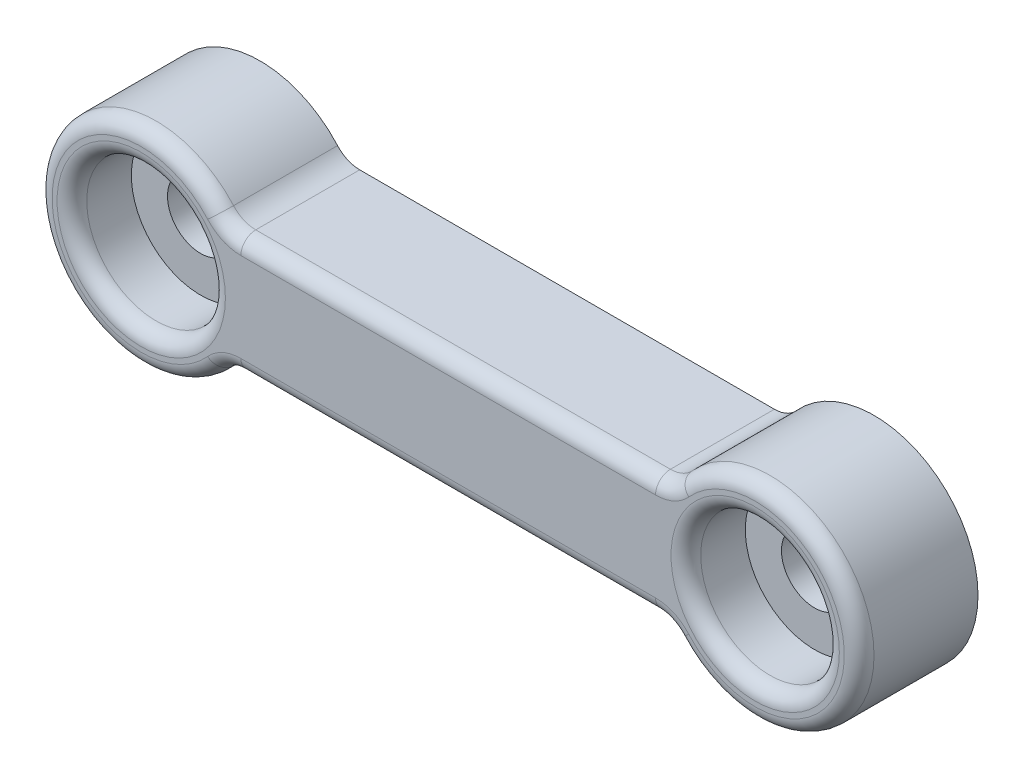
ISO-10303-21;
HEADER;
FILE_DESCRIPTION(('STEP AP214'),'2;1');
FILE_NAME('part.step','',(''),(''),'','','');
FILE_SCHEMA(('AUTOMOTIVE_DESIGN { 1 0 10303 214 1 1 1 1 }'));
ENDSEC;
DATA;
#1=APPLICATION_CONTEXT('core data for automotive mechanical design processes');
#2=APPLICATION_PROTOCOL_DEFINITION('international standard','automotive_design',2000,#1);
#3=PRODUCT_CONTEXT('',#1,'mechanical');
#4=PRODUCT('Part','Part','',(#3));
#5=PRODUCT_RELATED_PRODUCT_CATEGORY('part','',(#4));
#6=PRODUCT_DEFINITION_FORMATION('','',#4);
#7=PRODUCT_DEFINITION_CONTEXT('part definition',#1,'design');
#8=PRODUCT_DEFINITION('design','',#6,#7);
#9=PRODUCT_DEFINITION_SHAPE('','',#8);
#10=(LENGTH_UNIT() NAMED_UNIT(*) SI_UNIT(.MILLI.,.METRE.));
#11=(NAMED_UNIT(*) PLANE_ANGLE_UNIT() SI_UNIT($,.RADIAN.));
#12=(NAMED_UNIT(*) SI_UNIT($,.STERADIAN.) SOLID_ANGLE_UNIT());
#13=UNCERTAINTY_MEASURE_WITH_UNIT(LENGTH_MEASURE(1.E-05),#10,'distance_accuracy_value','');
#14=(GEOMETRIC_REPRESENTATION_CONTEXT(3) GLOBAL_UNCERTAINTY_ASSIGNED_CONTEXT((#13)) GLOBAL_UNIT_ASSIGNED_CONTEXT((#10,
#11,#12)) REPRESENTATION_CONTEXT('',''));
#15=CARTESIAN_POINT('',(0.,0.,0.));
#16=DIRECTION('',(0.,0.,1.));
#17=DIRECTION('',(1.,0.,0.));
#18=AXIS2_PLACEMENT_3D('',#15,#16,#17);
#19=CARTESIAN_POINT('',(15.5,0.,6.));
#20=DIRECTION('',(0.,0.,-1.));
#21=DIRECTION('',(-1.,0.,0.));
#22=AXIS2_PLACEMENT_3D('',#19,#20,#21);
#23=CYLINDRICAL_SURFACE('',#22,1.675);
#24=CARTESIAN_POINT('',(15.5,0.,0.));
#25=DIRECTION('',(0.,0.,1.));
#26=DIRECTION('',(1.,0.,0.));
#27=AXIS2_PLACEMENT_3D('',#24,#25,#26);
#28=CIRCLE('',#27,1.675);
#29=CARTESIAN_POINT('',(17.175,0.,0.));
#30=VERTEX_POINT('',#29);
#31=EDGE_CURVE('E152',#30,#30,#28,.T.);
#32=ORIENTED_EDGE('',*,*,#31,.F.);
#33=EDGE_LOOP('',(#32));
#34=FACE_BOUND('',#33,.T.);
#35=CARTESIAN_POINT('',(15.5,0.,3.));
#36=DIRECTION('',(0.,0.,1.));
#37=DIRECTION('',(1.,0.,0.));
#38=AXIS2_PLACEMENT_3D('',#35,#36,#37);
#39=CIRCLE('',#38,1.675);
#40=CARTESIAN_POINT('',(17.175,0.,3.));
#41=VERTEX_POINT('',#40);
#42=EDGE_CURVE('E190',#41,#41,#39,.T.);
#43=ORIENTED_EDGE('',*,*,#42,.T.);
#44=EDGE_LOOP('',(#43));
#45=FACE_BOUND('',#44,.T.);
#46=ADVANCED_FACE('F33',(#34,#45),#23,.F.);
#47=CARTESIAN_POINT('',(-15.5,0.,6.));
#48=DIRECTION('',(0.,0.,-1.));
#49=DIRECTION('',(-1.,0.,0.));
#50=AXIS2_PLACEMENT_3D('',#47,#48,#49);
#51=CYLINDRICAL_SURFACE('',#50,1.675);
#52=CARTESIAN_POINT('',(-15.5,0.,0.));
#53=DIRECTION('',(0.,0.,1.));
#54=DIRECTION('',(1.,0.,0.));
#55=AXIS2_PLACEMENT_3D('',#52,#53,#54);
#56=CIRCLE('',#55,1.675);
#57=CARTESIAN_POINT('',(-13.825,0.,0.));
#58=VERTEX_POINT('',#57);
#59=EDGE_CURVE('E155',#58,#58,#56,.T.);
#60=ORIENTED_EDGE('',*,*,#59,.F.);
#61=EDGE_LOOP('',(#60));
#62=FACE_BOUND('',#61,.T.);
#63=CARTESIAN_POINT('',(-15.5,0.,3.));
#64=DIRECTION('',(0.,0.,1.));
#65=DIRECTION('',(1.,0.,0.));
#66=AXIS2_PLACEMENT_3D('',#63,#64,#65);
#67=CIRCLE('',#66,1.675);
#68=CARTESIAN_POINT('',(-13.825,0.,3.));
#69=VERTEX_POINT('',#68);
#70=EDGE_CURVE('E186',#69,#69,#67,.T.);
#71=ORIENTED_EDGE('',*,*,#70,.T.);
#72=EDGE_LOOP('',(#71));
#73=FACE_BOUND('',#72,.T.);
#74=ADVANCED_FACE('F266',(#62,#73),#51,.F.);
#75=CARTESIAN_POINT('',(10.4688470506255,-4.5,6.));
#76=DIRECTION('',(0.,0.,1.));
#77=DIRECTION('',(1.,0.,0.));
#78=AXIS2_PLACEMENT_3D('',#75,#76,#77);
#79=PLANE('',#78);
#80=CARTESIAN_POINT('',(15.5,0.,6.));
#81=DIRECTION('',(0.,0.,1.));
#82=DIRECTION('',(1.,0.,0.));
#83=AXIS2_PLACEMENT_3D('',#80,#81,#82);
#84=CIRCLE('',#83,4.25);
#85=CARTESIAN_POINT('',(19.75,0.,6.));
#86=VERTEX_POINT('',#85);
#87=EDGE_CURVE('E213',#86,#86,#84,.F.);
#88=ORIENTED_EDGE('',*,*,#87,.T.);
#89=EDGE_LOOP('',(#88));
#90=FACE_BOUND('',#89,.T.);
#91=CARTESIAN_POINT('',(-15.5,0.,6.));
#92=DIRECTION('',(0.,0.,1.));
#93=DIRECTION('',(1.,0.,0.));
#94=AXIS2_PLACEMENT_3D('',#91,#92,#93);
#95=CIRCLE('',#94,4.25);
#96=CARTESIAN_POINT('',(-11.25,0.,6.));
#97=VERTEX_POINT('',#96);
#98=EDGE_CURVE('E210',#97,#97,#95,.F.);
#99=ORIENTED_EDGE('',*,*,#98,.T.);
#100=EDGE_LOOP('',(#99));
#101=FACE_BOUND('',#100,.T.);
#102=CARTESIAN_POINT('',(10.4688470506255,4.5,6.));
#103=DIRECTION('',(0.,0.,1.));
#104=DIRECTION('',(1.,0.,0.));
#105=AXIS2_PLACEMENT_3D('',#102,#103,#104);
#106=CIRCLE('',#105,2.25);
#107=CARTESIAN_POINT('',(12.1458980337503,3.00000000000001,6.));
#108=VERTEX_POINT('',#107);
#109=CARTESIAN_POINT('',(10.4688470506255,2.25,6.));
#110=VERTEX_POINT('',#109);
#111=EDGE_CURVE('E205',#108,#110,#106,.F.);
#112=ORIENTED_EDGE('',*,*,#111,.T.);
#113=DIRECTION('',(-1.,0.,0.));
#114=VECTOR('',#113,1.);
#115=CARTESIAN_POINT('',(-10.4688470506255,2.25,6.));
#116=LINE('',#115,#114);
#117=CARTESIAN_POINT('',(-10.4688470506255,2.25,6.));
#118=VERTEX_POINT('',#117);
#119=EDGE_CURVE('E207',#110,#118,#116,.T.);
#120=ORIENTED_EDGE('',*,*,#119,.T.);
#121=CARTESIAN_POINT('',(-10.4688470506255,4.5,6.));
#122=DIRECTION('',(0.,0.,1.));
#123=DIRECTION('',(1.,0.,0.));
#124=AXIS2_PLACEMENT_3D('',#121,#122,#123);
#125=CIRCLE('',#124,2.25);
#126=CARTESIAN_POINT('',(-12.1458980337503,3.,6.));
#127=VERTEX_POINT('',#126);
#128=EDGE_CURVE('E135',#118,#127,#125,.F.);
#129=ORIENTED_EDGE('',*,*,#128,.T.);
#130=CARTESIAN_POINT('',(-15.5,0.,6.));
#131=DIRECTION('',(0.,0.,1.));
#132=DIRECTION('',(1.,0.,0.));
#133=AXIS2_PLACEMENT_3D('',#130,#131,#132);
#134=CIRCLE('',#133,4.5);
#135=CARTESIAN_POINT('',(-12.1458980337503,-3.,6.));
#136=VERTEX_POINT('',#135);
#137=EDGE_CURVE('E195',#127,#136,#134,.T.);
#138=ORIENTED_EDGE('',*,*,#137,.T.);
#139=CARTESIAN_POINT('',(-10.4688470506255,-4.5,6.));
#140=DIRECTION('',(0.,0.,1.));
#141=DIRECTION('',(1.,0.,0.));
#142=AXIS2_PLACEMENT_3D('',#139,#140,#141);
#143=CIRCLE('',#142,2.25);
#144=CARTESIAN_POINT('',(-10.4688470506255,-2.25,6.));
#145=VERTEX_POINT('',#144);
#146=EDGE_CURVE('E197',#136,#145,#143,.F.);
#147=ORIENTED_EDGE('',*,*,#146,.T.);
#148=DIRECTION('',(1.,0.,0.));
#149=VECTOR('',#148,1.);
#150=CARTESIAN_POINT('',(10.4688470506255,-2.25,6.));
#151=LINE('',#150,#149);
#152=CARTESIAN_POINT('',(10.4688470506255,-2.25,6.));
#153=VERTEX_POINT('',#152);
#154=EDGE_CURVE('E199',#145,#153,#151,.T.);
#155=ORIENTED_EDGE('',*,*,#154,.T.);
#156=CARTESIAN_POINT('',(10.4688470506255,-4.5,6.));
#157=DIRECTION('',(0.,0.,1.));
#158=DIRECTION('',(1.,0.,0.));
#159=AXIS2_PLACEMENT_3D('',#156,#157,#158);
#160=CIRCLE('',#159,2.25);
#161=CARTESIAN_POINT('',(12.1458980337503,-3.,6.));
#162=VERTEX_POINT('',#161);
#163=EDGE_CURVE('E201',#153,#162,#160,.F.);
#164=ORIENTED_EDGE('',*,*,#163,.T.);
#165=CARTESIAN_POINT('',(15.5,0.,6.));
#166=DIRECTION('',(0.,0.,1.));
#167=DIRECTION('',(1.,0.,0.));
#168=AXIS2_PLACEMENT_3D('',#165,#166,#167);
#169=CIRCLE('',#168,4.5);
#170=EDGE_CURVE('E203',#162,#108,#169,.T.);
#171=ORIENTED_EDGE('',*,*,#170,.T.);
#172=EDGE_LOOP('',(#112,#120,#129,#138,#147,#155,#164,#171));
#173=FACE_BOUND('',#172,.T.);
#174=ADVANCED_FACE('F269',(#90,#101,#173),#79,.T.);
#175=CARTESIAN_POINT('',(10.4688470506255,-4.5,0.));
#176=DIRECTION('',(0.,0.,1.));
#177=DIRECTION('',(1.,0.,0.));
#178=AXIS2_PLACEMENT_3D('',#175,#176,#177);
#179=PLANE('',#178);
#180=ORIENTED_EDGE('',*,*,#31,.T.);
#181=EDGE_LOOP('',(#180));
#182=FACE_BOUND('',#181,.T.);
#183=CARTESIAN_POINT('',(10.4688470506255,-4.5,0.));
#184=DIRECTION('',(0.,0.,-1.));
#185=DIRECTION('',(1.,0.,0.));
#186=AXIS2_PLACEMENT_3D('',#183,#184,#185);
#187=CIRCLE('',#186,1.5);
#188=CARTESIAN_POINT('',(10.4688470506255,-3.,0.));
#189=VERTEX_POINT('',#188);
#190=CARTESIAN_POINT('',(11.5868810393754,-3.49999999999999,0.));
#191=VERTEX_POINT('',#190);
#192=EDGE_CURVE('E143',#189,#191,#187,.T.);
#193=ORIENTED_EDGE('',*,*,#192,.F.);
#194=DIRECTION('',(1.,0.,0.));
#195=VECTOR('',#194,1.);
#196=CARTESIAN_POINT('',(-10.4688470506255,-3.,0.));
#197=LINE('',#196,#195);
#198=CARTESIAN_POINT('',(-10.4688470506255,-3.,0.));
#199=VERTEX_POINT('',#198);
#200=EDGE_CURVE('E172',#199,#189,#197,.T.);
#201=ORIENTED_EDGE('',*,*,#200,.F.);
#202=CARTESIAN_POINT('',(-10.4688470506255,-4.5,0.));
#203=DIRECTION('',(0.,0.,-1.));
#204=DIRECTION('',(-1.,0.,0.));
#205=AXIS2_PLACEMENT_3D('',#202,#203,#204);
#206=CIRCLE('',#205,1.5);
#207=CARTESIAN_POINT('',(-11.5868810393754,-3.5,0.));
#208=VERTEX_POINT('',#207);
#209=EDGE_CURVE('E169',#208,#199,#206,.T.);
#210=ORIENTED_EDGE('',*,*,#209,.F.);
#211=CARTESIAN_POINT('',(-15.5,0.,0.));
#212=DIRECTION('',(0.,0.,1.));
#213=DIRECTION('',(1.,0.,0.));
#214=AXIS2_PLACEMENT_3D('',#211,#212,#213);
#215=CIRCLE('',#214,5.25);
#216=CARTESIAN_POINT('',(-11.5868810393754,3.5,0.));
#217=VERTEX_POINT('',#216);
#218=EDGE_CURVE('E166',#217,#208,#215,.T.);
#219=ORIENTED_EDGE('',*,*,#218,.F.);
#220=CARTESIAN_POINT('',(-10.4688470506255,4.5,0.));
#221=DIRECTION('',(0.,0.,-1.));
#222=DIRECTION('',(1.,0.,0.));
#223=AXIS2_PLACEMENT_3D('',#220,#221,#222);
#224=CIRCLE('',#223,1.5);
#225=CARTESIAN_POINT('',(-10.4688470506255,3.,0.));
#226=VERTEX_POINT('',#225);
#227=EDGE_CURVE('E163',#226,#217,#224,.T.);
#228=ORIENTED_EDGE('',*,*,#227,.F.);
#229=DIRECTION('',(-1.,0.,0.));
#230=VECTOR('',#229,1.);
#231=CARTESIAN_POINT('',(-10.4688470506255,3.,0.));
#232=LINE('',#231,#230);
#233=CARTESIAN_POINT('',(10.4688470506255,3.,0.));
#234=VERTEX_POINT('',#233);
#235=EDGE_CURVE('E160',#234,#226,#232,.T.);
#236=ORIENTED_EDGE('',*,*,#235,.F.);
#237=CARTESIAN_POINT('',(10.4688470506255,4.5,0.));
#238=DIRECTION('',(0.,0.,-1.));
#239=DIRECTION('',(-1.,0.,0.));
#240=AXIS2_PLACEMENT_3D('',#237,#238,#239);
#241=CIRCLE('',#240,1.5);
#242=CARTESIAN_POINT('',(11.5868810393754,3.50000000000001,0.));
#243=VERTEX_POINT('',#242);
#244=EDGE_CURVE('E146',#243,#234,#241,.T.);
#245=ORIENTED_EDGE('',*,*,#244,.F.);
#246=CARTESIAN_POINT('',(15.5,0.,0.));
#247=DIRECTION('',(0.,0.,1.));
#248=DIRECTION('',(1.,0.,0.));
#249=AXIS2_PLACEMENT_3D('',#246,#247,#248);
#250=CIRCLE('',#249,5.25);
#251=EDGE_CURVE('E128',#191,#243,#250,.T.);
#252=ORIENTED_EDGE('',*,*,#251,.F.);
#253=EDGE_LOOP('',(#193,#201,#210,#219,#228,#236,#245,#252));
#254=FACE_BOUND('',#253,.T.);
#255=ORIENTED_EDGE('',*,*,#59,.T.);
#256=EDGE_LOOP('',(#255));
#257=FACE_BOUND('',#256,.T.);
#258=ADVANCED_FACE('F140',(#182,#254,#257),#179,.F.);
#259=CARTESIAN_POINT('',(10.4688470506255,-4.5,6.));
#260=DIRECTION('',(0.,0.,-1.));
#261=DIRECTION('',(-1.,0.,0.));
#262=AXIS2_PLACEMENT_3D('',#259,#260,#261);
#263=CYLINDRICAL_SURFACE('',#262,1.5);
#264=DIRECTION('',(0.,0.,-1.));
#265=VECTOR('',#264,1.);
#266=CARTESIAN_POINT('',(11.5868810393754,-3.49999999999999,6.));
#267=LINE('',#266,#265);
#268=CARTESIAN_POINT('',(11.5868810393754,-3.49999999999999,5.25));
#269=VERTEX_POINT('',#268);
#270=EDGE_CURVE('E124',#269,#191,#267,.T.);
#271=ORIENTED_EDGE('',*,*,#270,.F.);
#272=CARTESIAN_POINT('',(10.4688470506255,-4.5,5.25));
#273=DIRECTION('',(0.,0.,1.));
#274=DIRECTION('',(1.,0.,0.));
#275=AXIS2_PLACEMENT_3D('',#272,#273,#274);
#276=CIRCLE('',#275,1.5);
#277=CARTESIAN_POINT('',(10.4688470506255,-3.,5.25));
#278=VERTEX_POINT('',#277);
#279=EDGE_CURVE('E222',#269,#278,#276,.T.);
#280=ORIENTED_EDGE('',*,*,#279,.T.);
#281=DIRECTION('',(0.,0.,-1.));
#282=VECTOR('',#281,1.);
#283=CARTESIAN_POINT('',(10.4688470506255,-3.,6.));
#284=LINE('',#283,#282);
#285=EDGE_CURVE('E150',#278,#189,#284,.T.);
#286=ORIENTED_EDGE('',*,*,#285,.T.);
#287=ORIENTED_EDGE('',*,*,#192,.T.);
#288=EDGE_LOOP('',(#271,#280,#286,#287));
#289=FACE_BOUND('',#288,.T.);
#290=ADVANCED_FACE('F148',(#289),#263,.F.);
#291=CARTESIAN_POINT('',(15.5,0.,6.));
#292=DIRECTION('',(0.,0.,-1.));
#293=DIRECTION('',(-1.,0.,0.));
#294=AXIS2_PLACEMENT_3D('',#291,#292,#293);
#295=CYLINDRICAL_SURFACE('',#294,5.25);
#296=DIRECTION('',(0.,0.,-1.));
#297=VECTOR('',#296,1.);
#298=CARTESIAN_POINT('',(11.5868810393754,3.50000000000001,6.));
#299=LINE('',#298,#297);
#300=CARTESIAN_POINT('',(11.5868810393754,3.50000000000001,5.25));
#301=VERTEX_POINT('',#300);
#302=EDGE_CURVE('E136',#301,#243,#299,.T.);
#303=ORIENTED_EDGE('',*,*,#302,.F.);
#304=CARTESIAN_POINT('',(15.5,0.,5.25));
#305=DIRECTION('',(0.,0.,1.));
#306=DIRECTION('',(1.,0.,0.));
#307=AXIS2_PLACEMENT_3D('',#304,#305,#306);
#308=CIRCLE('',#307,5.25);
#309=EDGE_CURVE('E131',#301,#269,#308,.F.);
#310=ORIENTED_EDGE('',*,*,#309,.T.);
#311=ORIENTED_EDGE('',*,*,#270,.T.);
#312=ORIENTED_EDGE('',*,*,#251,.T.);
#313=EDGE_LOOP('',(#303,#310,#311,#312));
#314=FACE_BOUND('',#313,.T.);
#315=ADVANCED_FACE('F127',(#314),#295,.T.);
#316=CARTESIAN_POINT('',(10.4688470506255,4.5,6.));
#317=DIRECTION('',(0.,0.,-1.));
#318=DIRECTION('',(-1.,0.,0.));
#319=AXIS2_PLACEMENT_3D('',#316,#317,#318);
#320=CYLINDRICAL_SURFACE('',#319,1.5);
#321=DIRECTION('',(0.,0.,-1.));
#322=VECTOR('',#321,1.);
#323=CARTESIAN_POINT('',(10.4688470506255,3.,6.));
#324=LINE('',#323,#322);
#325=CARTESIAN_POINT('',(10.4688470506255,3.,5.25));
#326=VERTEX_POINT('',#325);
#327=EDGE_CURVE('E183',#326,#234,#324,.T.);
#328=ORIENTED_EDGE('',*,*,#327,.F.);
#329=CARTESIAN_POINT('',(10.4688470506255,4.5,5.25));
#330=DIRECTION('',(0.,0.,1.));
#331=DIRECTION('',(1.,0.,0.));
#332=AXIS2_PLACEMENT_3D('',#329,#330,#331);
#333=CIRCLE('',#332,1.5);
#334=EDGE_CURVE('E219',#326,#301,#333,.T.);
#335=ORIENTED_EDGE('',*,*,#334,.T.);
#336=ORIENTED_EDGE('',*,*,#302,.T.);
#337=ORIENTED_EDGE('',*,*,#244,.T.);
#338=EDGE_LOOP('',(#328,#335,#336,#337));
#339=FACE_BOUND('',#338,.T.);
#340=ADVANCED_FACE('F317',(#339),#320,.F.);
#341=CARTESIAN_POINT('',(-10.4688470506255,3.,6.));
#342=DIRECTION('',(0.,-1.,0.));
#343=DIRECTION('',(1.,0.,0.));
#344=AXIS2_PLACEMENT_3D('',#341,#342,#343);
#345=PLANE('',#344);
#346=DIRECTION('',(0.,0.,-1.));
#347=VECTOR('',#346,1.);
#348=CARTESIAN_POINT('',(-10.4688470506255,3.,6.));
#349=LINE('',#348,#347);
#350=CARTESIAN_POINT('',(-10.4688470506255,3.,5.25));
#351=VERTEX_POINT('',#350);
#352=EDGE_CURVE('E181',#351,#226,#349,.T.);
#353=ORIENTED_EDGE('',*,*,#352,.F.);
#354=DIRECTION('',(-1.,0.,0.));
#355=VECTOR('',#354,1.);
#356=CARTESIAN_POINT('',(10.4688470506255,3.,5.25));
#357=LINE('',#356,#355);
#358=EDGE_CURVE('E216',#351,#326,#357,.F.);
#359=ORIENTED_EDGE('',*,*,#358,.T.);
#360=ORIENTED_EDGE('',*,*,#327,.T.);
#361=ORIENTED_EDGE('',*,*,#235,.T.);
#362=EDGE_LOOP('',(#353,#359,#360,#361));
#363=FACE_BOUND('',#362,.T.);
#364=ADVANCED_FACE('F313',(#363),#345,.F.);
#365=CARTESIAN_POINT('',(-10.4688470506255,4.5,6.));
#366=DIRECTION('',(0.,0.,-1.));
#367=DIRECTION('',(-1.,0.,0.));
#368=AXIS2_PLACEMENT_3D('',#365,#366,#367);
#369=CYLINDRICAL_SURFACE('',#368,1.5);
#370=DIRECTION('',(0.,0.,-1.));
#371=VECTOR('',#370,1.);
#372=CARTESIAN_POINT('',(-11.5868810393754,3.5,6.));
#373=LINE('',#372,#371);
#374=CARTESIAN_POINT('',(-11.5868810393754,3.5,5.25));
#375=VERTEX_POINT('',#374);
#376=EDGE_CURVE('E179',#375,#217,#373,.T.);
#377=ORIENTED_EDGE('',*,*,#376,.F.);
#378=CARTESIAN_POINT('',(-10.4688470506255,4.5,5.25));
#379=DIRECTION('',(0.,0.,1.));
#380=DIRECTION('',(1.,0.,0.));
#381=AXIS2_PLACEMENT_3D('',#378,#379,#380);
#382=CIRCLE('',#381,1.5);
#383=EDGE_CURVE('E11',#375,#351,#382,.T.);
#384=ORIENTED_EDGE('',*,*,#383,.T.);
#385=ORIENTED_EDGE('',*,*,#352,.T.);
#386=ORIENTED_EDGE('',*,*,#227,.T.);
#387=EDGE_LOOP('',(#377,#384,#385,#386));
#388=FACE_BOUND('',#387,.T.);
#389=ADVANCED_FACE('F310',(#388),#369,.F.);
#390=CARTESIAN_POINT('',(-15.5,0.,6.));
#391=DIRECTION('',(0.,0.,-1.));
#392=DIRECTION('',(-1.,0.,0.));
#393=AXIS2_PLACEMENT_3D('',#390,#391,#392);
#394=CYLINDRICAL_SURFACE('',#393,5.25);
#395=DIRECTION('',(0.,0.,-1.));
#396=VECTOR('',#395,1.);
#397=CARTESIAN_POINT('',(-11.5868810393754,-3.5,6.));
#398=LINE('',#397,#396);
#399=CARTESIAN_POINT('',(-11.5868810393754,-3.5,5.25));
#400=VERTEX_POINT('',#399);
#401=EDGE_CURVE('E177',#400,#208,#398,.T.);
#402=ORIENTED_EDGE('',*,*,#401,.F.);
#403=CARTESIAN_POINT('',(-15.5,0.,5.25));
#404=DIRECTION('',(0.,0.,1.));
#405=DIRECTION('',(1.,0.,0.));
#406=AXIS2_PLACEMENT_3D('',#403,#404,#405);
#407=CIRCLE('',#406,5.25);
#408=EDGE_CURVE('E50',#400,#375,#407,.F.);
#409=ORIENTED_EDGE('',*,*,#408,.T.);
#410=ORIENTED_EDGE('',*,*,#376,.T.);
#411=ORIENTED_EDGE('',*,*,#218,.T.);
#412=EDGE_LOOP('',(#402,#409,#410,#411));
#413=FACE_BOUND('',#412,.T.);
#414=ADVANCED_FACE('F307',(#413),#394,.T.);
#415=CARTESIAN_POINT('',(-10.4688470506255,-4.5,6.));
#416=DIRECTION('',(0.,0.,-1.));
#417=DIRECTION('',(-1.,0.,0.));
#418=AXIS2_PLACEMENT_3D('',#415,#416,#417);
#419=CYLINDRICAL_SURFACE('',#418,1.5);
#420=DIRECTION('',(0.,0.,-1.));
#421=VECTOR('',#420,1.);
#422=CARTESIAN_POINT('',(-10.4688470506255,-3.,6.));
#423=LINE('',#422,#421);
#424=CARTESIAN_POINT('',(-10.4688470506255,-3.,5.25));
#425=VERTEX_POINT('',#424);
#426=EDGE_CURVE('E175',#425,#199,#423,.T.);
#427=ORIENTED_EDGE('',*,*,#426,.F.);
#428=CARTESIAN_POINT('',(-10.4688470506255,-4.5,5.25));
#429=DIRECTION('',(0.,0.,1.));
#430=DIRECTION('',(1.,0.,0.));
#431=AXIS2_PLACEMENT_3D('',#428,#429,#430);
#432=CIRCLE('',#431,1.5);
#433=EDGE_CURVE('E58',#425,#400,#432,.T.);
#434=ORIENTED_EDGE('',*,*,#433,.T.);
#435=ORIENTED_EDGE('',*,*,#401,.T.);
#436=ORIENTED_EDGE('',*,*,#209,.T.);
#437=EDGE_LOOP('',(#427,#434,#435,#436));
#438=FACE_BOUND('',#437,.T.);
#439=ADVANCED_FACE('F288',(#438),#419,.F.);
#440=CARTESIAN_POINT('',(-10.4688470506255,-3.,6.));
#441=DIRECTION('',(0.,1.,0.));
#442=DIRECTION('',(-1.,0.,0.));
#443=AXIS2_PLACEMENT_3D('',#440,#441,#442);
#444=PLANE('',#443);
#445=ORIENTED_EDGE('',*,*,#285,.F.);
#446=DIRECTION('',(1.,0.,0.));
#447=VECTOR('',#446,1.);
#448=CARTESIAN_POINT('',(-10.4688470506255,-3.,5.25));
#449=LINE('',#448,#447);
#450=EDGE_CURVE('E224',#278,#425,#449,.F.);
#451=ORIENTED_EDGE('',*,*,#450,.T.);
#452=ORIENTED_EDGE('',*,*,#426,.T.);
#453=ORIENTED_EDGE('',*,*,#200,.T.);
#454=EDGE_LOOP('',(#445,#451,#452,#453));
#455=FACE_BOUND('',#454,.T.);
#456=ADVANCED_FACE('F282',(#455),#444,.F.);
#457=CARTESIAN_POINT('',(-15.5,0.,3.));
#458=DIRECTION('',(0.,0.,1.));
#459=DIRECTION('',(1.,0.,0.));
#460=AXIS2_PLACEMENT_3D('',#457,#458,#459);
#461=CYLINDRICAL_SURFACE('',#460,3.5);
#462=CARTESIAN_POINT('',(-15.5,0.,5.25));
#463=DIRECTION('',(0.,0.,1.));
#464=DIRECTION('',(1.,0.,0.));
#465=AXIS2_PLACEMENT_3D('',#462,#463,#464);
#466=CIRCLE('',#465,3.5);
#467=CARTESIAN_POINT('',(-12.,0.,5.25));
#468=VERTEX_POINT('',#467);
#469=EDGE_CURVE('E42',#468,#468,#466,.T.);
#470=ORIENTED_EDGE('',*,*,#469,.T.);
#471=EDGE_LOOP('',(#470));
#472=FACE_BOUND('',#471,.T.);
#473=CARTESIAN_POINT('',(-15.5,0.,3.));
#474=DIRECTION('',(0.,0.,1.));
#475=DIRECTION('',(1.,0.,0.));
#476=AXIS2_PLACEMENT_3D('',#473,#474,#475);
#477=CIRCLE('',#476,3.5);
#478=CARTESIAN_POINT('',(-12.,0.,3.));
#479=VERTEX_POINT('',#478);
#480=EDGE_CURVE('E189',#479,#479,#477,.T.);
#481=ORIENTED_EDGE('',*,*,#480,.F.);
#482=EDGE_LOOP('',(#481));
#483=FACE_BOUND('',#482,.T.);
#484=ADVANCED_FACE('F277',(#472,#483),#461,.F.);
#485=CARTESIAN_POINT('',(-15.5,0.,3.));
#486=DIRECTION('',(0.,0.,1.));
#487=DIRECTION('',(1.,0.,0.));
#488=AXIS2_PLACEMENT_3D('',#485,#486,#487);
#489=PLANE('',#488);
#490=ORIENTED_EDGE('',*,*,#70,.F.);
#491=EDGE_LOOP('',(#490));
#492=FACE_BOUND('',#491,.T.);
#493=ORIENTED_EDGE('',*,*,#480,.T.);
#494=EDGE_LOOP('',(#493));
#495=FACE_BOUND('',#494,.T.);
#496=ADVANCED_FACE('F273',(#492,#495),#489,.T.);
#497=CARTESIAN_POINT('',(15.5,0.,3.));
#498=DIRECTION('',(0.,0.,1.));
#499=DIRECTION('',(1.,0.,0.));
#500=AXIS2_PLACEMENT_3D('',#497,#498,#499);
#501=CYLINDRICAL_SURFACE('',#500,3.5);
#502=CARTESIAN_POINT('',(15.5,0.,5.25));
#503=DIRECTION('',(0.,0.,1.));
#504=DIRECTION('',(1.,0.,0.));
#505=AXIS2_PLACEMENT_3D('',#502,#503,#504);
#506=CIRCLE('',#505,3.5);
#507=CARTESIAN_POINT('',(19.,0.,5.25));
#508=VERTEX_POINT('',#507);
#509=EDGE_CURVE('E228',#508,#508,#506,.T.);
#510=ORIENTED_EDGE('',*,*,#509,.T.);
#511=EDGE_LOOP('',(#510));
#512=FACE_BOUND('',#511,.T.);
#513=CARTESIAN_POINT('',(15.5,0.,3.));
#514=DIRECTION('',(0.,0.,1.));
#515=DIRECTION('',(1.,0.,0.));
#516=AXIS2_PLACEMENT_3D('',#513,#514,#515);
#517=CIRCLE('',#516,3.5);
#518=CARTESIAN_POINT('',(19.,0.,3.));
#519=VERTEX_POINT('',#518);
#520=EDGE_CURVE('E193',#519,#519,#517,.T.);
#521=ORIENTED_EDGE('',*,*,#520,.F.);
#522=EDGE_LOOP('',(#521));
#523=FACE_BOUND('',#522,.T.);
#524=ADVANCED_FACE('F276',(#512,#523),#501,.F.);
#525=CARTESIAN_POINT('',(15.5,0.,3.));
#526=DIRECTION('',(0.,0.,1.));
#527=DIRECTION('',(1.,0.,0.));
#528=AXIS2_PLACEMENT_3D('',#525,#526,#527);
#529=PLANE('',#528);
#530=ORIENTED_EDGE('',*,*,#42,.F.);
#531=EDGE_LOOP('',(#530));
#532=FACE_BOUND('',#531,.T.);
#533=ORIENTED_EDGE('',*,*,#520,.T.);
#534=EDGE_LOOP('',(#533));
#535=FACE_BOUND('',#534,.T.);
#536=ADVANCED_FACE('F355',(#532,#535),#529,.T.);
#537=CARTESIAN_POINT('',(10.4688470506255,-2.25,5.25));
#538=DIRECTION('',(-1.,0.,0.));
#539=DIRECTION('',(0.,-1.,0.));
#540=AXIS2_PLACEMENT_3D('',#537,#538,#539);
#541=CYLINDRICAL_SURFACE('',#540,0.75);
#542=CARTESIAN_POINT('',(-10.4688470506255,-2.25,5.25));
#543=DIRECTION('',(-1.,0.,0.));
#544=DIRECTION('',(0.,0.,1.));
#545=AXIS2_PLACEMENT_3D('',#542,#543,#544);
#546=CIRCLE('',#545,0.75);
#547=EDGE_CURVE('E248',#425,#145,#546,.T.);
#548=ORIENTED_EDGE('',*,*,#547,.F.);
#549=ORIENTED_EDGE('',*,*,#450,.F.);
#550=CARTESIAN_POINT('',(10.4688470506255,-2.25,5.25));
#551=DIRECTION('',(1.,0.,0.));
#552=DIRECTION('',(0.,0.,-1.));
#553=AXIS2_PLACEMENT_3D('',#550,#551,#552);
#554=CIRCLE('',#553,0.75);
#555=EDGE_CURVE('E37',#153,#278,#554,.T.);
#556=ORIENTED_EDGE('',*,*,#555,.F.);
#557=ORIENTED_EDGE('',*,*,#154,.F.);
#558=EDGE_LOOP('',(#548,#549,#556,#557));
#559=FACE_BOUND('',#558,.T.);
#560=ADVANCED_FACE('F353',(#559),#541,.T.);
#561=CARTESIAN_POINT('',(10.4688470506255,-4.5,5.25));
#562=DIRECTION('',(0.,0.,1.));
#563=DIRECTION('',(1.,0.,0.));
#564=AXIS2_PLACEMENT_3D('',#561,#562,#563);
#565=TOROIDAL_SURFACE('',#564,2.25,0.75);
#566=ORIENTED_EDGE('',*,*,#555,.T.);
#567=ORIENTED_EDGE('',*,*,#279,.F.);
#568=CARTESIAN_POINT('',(12.1458980337503,-3.,5.25));
#569=DIRECTION('',(0.666666666666667,-0.74535599249993,0.));
#570=DIRECTION('',(0.74535599249993,0.666666666666667,0.));
#571=AXIS2_PLACEMENT_3D('',#568,#569,#570);
#572=CIRCLE('',#571,0.75);
#573=EDGE_CURVE('E246',#162,#269,#572,.T.);
#574=ORIENTED_EDGE('',*,*,#573,.F.);
#575=ORIENTED_EDGE('',*,*,#163,.F.);
#576=EDGE_LOOP('',(#566,#567,#574,#575));
#577=FACE_BOUND('',#576,.T.);
#578=ADVANCED_FACE('F350',(#577),#565,.T.);
#579=CARTESIAN_POINT('',(-10.4688470506255,-4.5,5.25));
#580=DIRECTION('',(0.,0.,1.));
#581=DIRECTION('',(1.,0.,0.));
#582=AXIS2_PLACEMENT_3D('',#579,#580,#581);
#583=TOROIDAL_SURFACE('',#582,2.25,0.75);
#584=ORIENTED_EDGE('',*,*,#547,.T.);
#585=ORIENTED_EDGE('',*,*,#146,.F.);
#586=CARTESIAN_POINT('',(-12.1458980337503,-3.,5.25));
#587=DIRECTION('',(-0.666666666666666,-0.745355992499931,0.));
#588=DIRECTION('',(0.745355992499931,-0.666666666666666,0.));
#589=AXIS2_PLACEMENT_3D('',#586,#587,#588);
#590=CIRCLE('',#589,0.75);
#591=EDGE_CURVE('E243',#400,#136,#590,.T.);
#592=ORIENTED_EDGE('',*,*,#591,.F.);
#593=ORIENTED_EDGE('',*,*,#433,.F.);
#594=EDGE_LOOP('',(#584,#585,#592,#593));
#595=FACE_BOUND('',#594,.T.);
#596=ADVANCED_FACE('F346',(#595),#583,.T.);
#597=CARTESIAN_POINT('',(15.5,0.,5.25));
#598=DIRECTION('',(0.,0.,1.));
#599=DIRECTION('',(1.,0.,0.));
#600=AXIS2_PLACEMENT_3D('',#597,#598,#599);
#601=TOROIDAL_SURFACE('',#600,4.5,0.75);
#602=ORIENTED_EDGE('',*,*,#573,.T.);
#603=ORIENTED_EDGE('',*,*,#309,.F.);
#604=CARTESIAN_POINT('',(12.1458980337503,3.00000000000001,5.25));
#605=DIRECTION('',(-0.666666666666666,-0.74535599249993,0.));
#606=DIRECTION('',(0.74535599249993,-0.666666666666666,0.));
#607=AXIS2_PLACEMENT_3D('',#604,#605,#606);
#608=CIRCLE('',#607,0.75);
#609=EDGE_CURVE('E240',#108,#301,#608,.T.);
#610=ORIENTED_EDGE('',*,*,#609,.F.);
#611=ORIENTED_EDGE('',*,*,#170,.F.);
#612=EDGE_LOOP('',(#602,#603,#610,#611));
#613=FACE_BOUND('',#612,.T.);
#614=ADVANCED_FACE('F342',(#613),#601,.T.);
#615=CARTESIAN_POINT('',(-15.5,0.,5.25));
#616=DIRECTION('',(0.,0.,1.));
#617=DIRECTION('',(1.,0.,0.));
#618=AXIS2_PLACEMENT_3D('',#615,#616,#617);
#619=TOROIDAL_SURFACE('',#618,4.5,0.75);
#620=ORIENTED_EDGE('',*,*,#591,.T.);
#621=ORIENTED_EDGE('',*,*,#137,.F.);
#622=CARTESIAN_POINT('',(-12.1458980337503,3.,5.25));
#623=DIRECTION('',(0.666666666666667,-0.74535599249993,0.));
#624=DIRECTION('',(0.74535599249993,0.666666666666667,0.));
#625=AXIS2_PLACEMENT_3D('',#622,#623,#624);
#626=CIRCLE('',#625,0.75);
#627=EDGE_CURVE('E237',#375,#127,#626,.T.);
#628=ORIENTED_EDGE('',*,*,#627,.F.);
#629=ORIENTED_EDGE('',*,*,#408,.F.);
#630=EDGE_LOOP('',(#620,#621,#628,#629));
#631=FACE_BOUND('',#630,.T.);
#632=ADVANCED_FACE('F338',(#631),#619,.T.);
#633=CARTESIAN_POINT('',(10.4688470506255,4.5,5.25));
#634=DIRECTION('',(0.,0.,1.));
#635=DIRECTION('',(1.,0.,0.));
#636=AXIS2_PLACEMENT_3D('',#633,#634,#635);
#637=TOROIDAL_SURFACE('',#636,2.25,0.75);
#638=ORIENTED_EDGE('',*,*,#609,.T.);
#639=ORIENTED_EDGE('',*,*,#334,.F.);
#640=CARTESIAN_POINT('',(10.4688470506255,2.25,5.25));
#641=DIRECTION('',(-1.,0.,0.));
#642=DIRECTION('',(0.,0.,1.));
#643=AXIS2_PLACEMENT_3D('',#640,#641,#642);
#644=CIRCLE('',#643,0.75);
#645=EDGE_CURVE('E235',#110,#326,#644,.T.);
#646=ORIENTED_EDGE('',*,*,#645,.F.);
#647=ORIENTED_EDGE('',*,*,#111,.F.);
#648=EDGE_LOOP('',(#638,#639,#646,#647));
#649=FACE_BOUND('',#648,.T.);
#650=ADVANCED_FACE('F334',(#649),#637,.T.);
#651=CARTESIAN_POINT('',(-10.4688470506255,4.5,5.25));
#652=DIRECTION('',(0.,0.,1.));
#653=DIRECTION('',(1.,0.,0.));
#654=AXIS2_PLACEMENT_3D('',#651,#652,#653);
#655=TOROIDAL_SURFACE('',#654,2.25,0.75);
#656=ORIENTED_EDGE('',*,*,#627,.T.);
#657=ORIENTED_EDGE('',*,*,#128,.F.);
#658=CARTESIAN_POINT('',(-10.4688470506255,2.25,5.25));
#659=DIRECTION('',(1.,0.,0.));
#660=DIRECTION('',(0.,0.,-1.));
#661=AXIS2_PLACEMENT_3D('',#658,#659,#660);
#662=CIRCLE('',#661,0.75);
#663=EDGE_CURVE('E233',#351,#118,#662,.T.);
#664=ORIENTED_EDGE('',*,*,#663,.F.);
#665=ORIENTED_EDGE('',*,*,#383,.F.);
#666=EDGE_LOOP('',(#656,#657,#664,#665));
#667=FACE_BOUND('',#666,.T.);
#668=ADVANCED_FACE('F330',(#667),#655,.T.);
#669=CARTESIAN_POINT('',(10.4688470506255,2.25,5.25));
#670=DIRECTION('',(1.,0.,0.));
#671=DIRECTION('',(0.,1.,0.));
#672=AXIS2_PLACEMENT_3D('',#669,#670,#671);
#673=CYLINDRICAL_SURFACE('',#672,0.75);
#674=ORIENTED_EDGE('',*,*,#645,.T.);
#675=ORIENTED_EDGE('',*,*,#358,.F.);
#676=ORIENTED_EDGE('',*,*,#663,.T.);
#677=ORIENTED_EDGE('',*,*,#119,.F.);
#678=EDGE_LOOP('',(#674,#675,#676,#677));
#679=FACE_BOUND('',#678,.T.);
#680=ADVANCED_FACE('F326',(#679),#673,.T.);
#681=CARTESIAN_POINT('',(15.5,0.,5.25));
#682=DIRECTION('',(0.,0.,1.));
#683=DIRECTION('',(1.,0.,0.));
#684=AXIS2_PLACEMENT_3D('',#681,#682,#683);
#685=TOROIDAL_SURFACE('',#684,4.25,0.75);
#686=ORIENTED_EDGE('',*,*,#87,.F.);
#687=EDGE_LOOP('',(#686));
#688=FACE_BOUND('',#687,.T.);
#689=ORIENTED_EDGE('',*,*,#509,.F.);
#690=EDGE_LOOP('',(#689));
#691=FACE_BOUND('',#690,.T.);
#692=ADVANCED_FACE('F329',(#688,#691),#685,.T.);
#693=CARTESIAN_POINT('',(-15.5,0.,5.25));
#694=DIRECTION('',(0.,0.,1.));
#695=DIRECTION('',(1.,0.,0.));
#696=AXIS2_PLACEMENT_3D('',#693,#694,#695);
#697=TOROIDAL_SURFACE('',#696,4.25,0.75);
#698=ORIENTED_EDGE('',*,*,#98,.F.);
#699=EDGE_LOOP('',(#698));
#700=FACE_BOUND('',#699,.T.);
#701=ORIENTED_EDGE('',*,*,#469,.F.);
#702=EDGE_LOOP('',(#701));
#703=FACE_BOUND('',#702,.T.);
#704=ADVANCED_FACE('F35',(#700,#703),#697,.T.);
#705=CLOSED_SHELL('',(#46,#74,#174,#258,#290,#315,#340,#364,#389,#414,#439,#456,#484,#496,#524,
#536,#560,#578,#596,#614,#632,#650,#668,#680,#692,#704));
#706=MANIFOLD_SOLID_BREP('B2',#705);
#707=ADVANCED_BREP_SHAPE_REPRESENTATION('',(#18,#706),#14);
#708=SHAPE_DEFINITION_REPRESENTATION(#9,#707);
ENDSEC;
END-ISO-10303-21;
